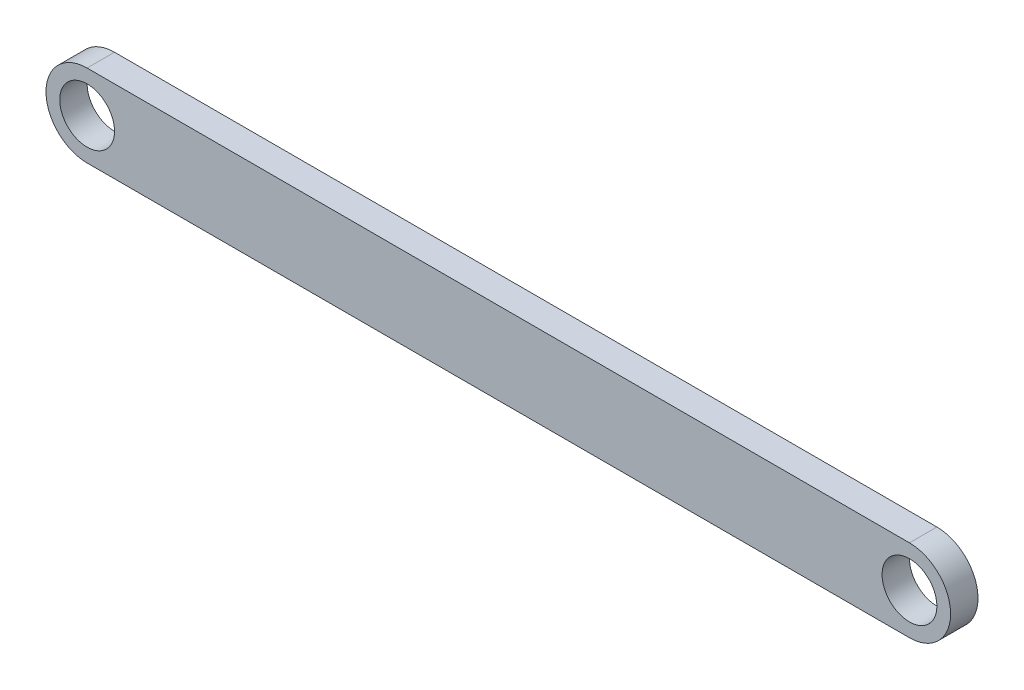
ISO-10303-21;
HEADER;
FILE_DESCRIPTION(('STEP AP214'),'2;1');
FILE_NAME('part.step','',(''),(''),'','','');
FILE_SCHEMA(('AUTOMOTIVE_DESIGN { 1 0 10303 214 1 1 1 1 }'));
ENDSEC;
DATA;
#1=APPLICATION_CONTEXT('core data for automotive mechanical design processes');
#2=APPLICATION_PROTOCOL_DEFINITION('international standard','automotive_design',2000,#1);
#3=PRODUCT_CONTEXT('',#1,'mechanical');
#4=PRODUCT('Part','Part','',(#3));
#5=PRODUCT_RELATED_PRODUCT_CATEGORY('part','',(#4));
#6=PRODUCT_DEFINITION_FORMATION('','',#4);
#7=PRODUCT_DEFINITION_CONTEXT('part definition',#1,'design');
#8=PRODUCT_DEFINITION('design','',#6,#7);
#9=PRODUCT_DEFINITION_SHAPE('','',#8);
#10=(LENGTH_UNIT() NAMED_UNIT(*) SI_UNIT(.MILLI.,.METRE.));
#11=(NAMED_UNIT(*) PLANE_ANGLE_UNIT() SI_UNIT($,.RADIAN.));
#12=(NAMED_UNIT(*) SI_UNIT($,.STERADIAN.) SOLID_ANGLE_UNIT());
#13=UNCERTAINTY_MEASURE_WITH_UNIT(LENGTH_MEASURE(1.E-05),#10,'distance_accuracy_value','');
#14=(GEOMETRIC_REPRESENTATION_CONTEXT(3) GLOBAL_UNCERTAINTY_ASSIGNED_CONTEXT((#13)) GLOBAL_UNIT_ASSIGNED_CONTEXT((#10,
#11,#12)) REPRESENTATION_CONTEXT('',''));
#15=CARTESIAN_POINT('',(0.,0.,0.));
#16=DIRECTION('',(0.,0.,1.));
#17=DIRECTION('',(1.,0.,0.));
#18=AXIS2_PLACEMENT_3D('',#15,#16,#17);
#19=CARTESIAN_POINT('',(-44.7706437358501,0.,2.));
#20=DIRECTION('',(0.,0.,1.));
#21=DIRECTION('',(1.,0.,0.));
#22=AXIS2_PLACEMENT_3D('',#19,#20,#21);
#23=PLANE('',#22);
#24=CARTESIAN_POINT('',(-44.7706437358501,0.,2.));
#25=DIRECTION('',(0.,0.,1.));
#26=DIRECTION('',(1.,0.,0.));
#27=AXIS2_PLACEMENT_3D('',#24,#25,#26);
#28=CIRCLE('',#27,2.);
#29=CARTESIAN_POINT('',(-42.7706437358501,0.,2.));
#30=VERTEX_POINT('',#29);
#31=EDGE_CURVE('E98',#30,#30,#28,.T.);
#32=ORIENTED_EDGE('',*,*,#31,.F.);
#33=EDGE_LOOP('',(#32));
#34=FACE_BOUND('',#33,.T.);
#35=CARTESIAN_POINT('',(-44.7706437358501,0.,2.));
#36=DIRECTION('',(0.,0.,1.));
#37=DIRECTION('',(1.,0.,0.));
#38=AXIS2_PLACEMENT_3D('',#35,#36,#37);
#39=CIRCLE('',#38,3.);
#40=CARTESIAN_POINT('',(-44.7706437358501,3.,2.));
#41=VERTEX_POINT('',#40);
#42=CARTESIAN_POINT('',(-44.7706437358501,-3.,2.));
#43=VERTEX_POINT('',#42);
#44=EDGE_CURVE('E83',#41,#43,#39,.T.);
#45=ORIENTED_EDGE('',*,*,#44,.T.);
#46=DIRECTION('',(1.,0.,0.));
#47=VECTOR('',#46,1.);
#48=CARTESIAN_POINT('',(-44.7706437358501,-3.,2.));
#49=LINE('',#48,#47);
#50=CARTESIAN_POINT('',(15.2293562641499,-3.,2.));
#51=VERTEX_POINT('',#50);
#52=EDGE_CURVE('E78',#43,#51,#49,.T.);
#53=ORIENTED_EDGE('',*,*,#52,.T.);
#54=CARTESIAN_POINT('',(15.2293562641499,0.,2.));
#55=DIRECTION('',(0.,0.,1.));
#56=DIRECTION('',(1.,0.,0.));
#57=AXIS2_PLACEMENT_3D('',#54,#55,#56);
#58=CIRCLE('',#57,3.);
#59=CARTESIAN_POINT('',(15.2293562641499,3.,2.));
#60=VERTEX_POINT('',#59);
#61=EDGE_CURVE('E81',#51,#60,#58,.T.);
#62=ORIENTED_EDGE('',*,*,#61,.T.);
#63=DIRECTION('',(-1.,0.,0.));
#64=VECTOR('',#63,1.);
#65=CARTESIAN_POINT('',(-44.7706437358501,3.,2.));
#66=LINE('',#65,#64);
#67=EDGE_CURVE('E48',#60,#41,#66,.T.);
#68=ORIENTED_EDGE('',*,*,#67,.T.);
#69=EDGE_LOOP('',(#45,#53,#62,#68));
#70=FACE_BOUND('',#69,.T.);
#71=CARTESIAN_POINT('',(15.2293562641499,0.,2.));
#72=DIRECTION('',(0.,0.,1.));
#73=DIRECTION('',(1.,0.,0.));
#74=AXIS2_PLACEMENT_3D('',#71,#72,#73);
#75=CIRCLE('',#74,2.);
#76=CARTESIAN_POINT('',(17.2293562641499,0.,2.));
#77=VERTEX_POINT('',#76);
#78=EDGE_CURVE('E113',#77,#77,#75,.T.);
#79=ORIENTED_EDGE('',*,*,#78,.F.);
#80=EDGE_LOOP('',(#79));
#81=FACE_BOUND('',#80,.T.);
#82=ADVANCED_FACE('F31',(#34,#70,#81),#23,.T.);
#83=CARTESIAN_POINT('',(-44.7706437358501,0.,0.));
#84=DIRECTION('',(0.,0.,1.));
#85=DIRECTION('',(1.,0.,0.));
#86=AXIS2_PLACEMENT_3D('',#83,#84,#85);
#87=PLANE('',#86);
#88=CARTESIAN_POINT('',(-44.7706437358501,0.,0.));
#89=DIRECTION('',(0.,0.,1.));
#90=DIRECTION('',(1.,0.,0.));
#91=AXIS2_PLACEMENT_3D('',#88,#89,#90);
#92=CIRCLE('',#91,2.);
#93=CARTESIAN_POINT('',(-42.7706437358501,0.,0.));
#94=VERTEX_POINT('',#93);
#95=EDGE_CURVE('E110',#94,#94,#92,.T.);
#96=ORIENTED_EDGE('',*,*,#95,.T.);
#97=EDGE_LOOP('',(#96));
#98=FACE_BOUND('',#97,.T.);
#99=CARTESIAN_POINT('',(-44.7706437358501,0.,0.));
#100=DIRECTION('',(0.,0.,1.));
#101=DIRECTION('',(1.,0.,0.));
#102=AXIS2_PLACEMENT_3D('',#99,#100,#101);
#103=CIRCLE('',#102,3.);
#104=CARTESIAN_POINT('',(-44.7706437358501,3.,0.));
#105=VERTEX_POINT('',#104);
#106=CARTESIAN_POINT('',(-44.7706437358501,-3.,0.));
#107=VERTEX_POINT('',#106);
#108=EDGE_CURVE('E95',#105,#107,#103,.T.);
#109=ORIENTED_EDGE('',*,*,#108,.F.);
#110=DIRECTION('',(-1.,0.,0.));
#111=VECTOR('',#110,1.);
#112=CARTESIAN_POINT('',(-44.7706437358501,3.,0.));
#113=LINE('',#112,#111);
#114=CARTESIAN_POINT('',(15.2293562641499,3.,0.));
#115=VERTEX_POINT('',#114);
#116=EDGE_CURVE('E71',#115,#105,#113,.T.);
#117=ORIENTED_EDGE('',*,*,#116,.F.);
#118=CARTESIAN_POINT('',(15.2293562641499,0.,0.));
#119=DIRECTION('',(0.,0.,1.));
#120=DIRECTION('',(1.,0.,0.));
#121=AXIS2_PLACEMENT_3D('',#118,#119,#120);
#122=CIRCLE('',#121,3.);
#123=CARTESIAN_POINT('',(15.2293562641499,-3.,0.));
#124=VERTEX_POINT('',#123);
#125=EDGE_CURVE('E65',#124,#115,#122,.T.);
#126=ORIENTED_EDGE('',*,*,#125,.F.);
#127=DIRECTION('',(1.,0.,0.));
#128=VECTOR('',#127,1.);
#129=CARTESIAN_POINT('',(-44.7706437358501,-3.,0.));
#130=LINE('',#129,#128);
#131=EDGE_CURVE('E87',#107,#124,#130,.T.);
#132=ORIENTED_EDGE('',*,*,#131,.F.);
#133=EDGE_LOOP('',(#109,#117,#126,#132));
#134=FACE_BOUND('',#133,.T.);
#135=CARTESIAN_POINT('',(15.2293562641499,0.,0.));
#136=DIRECTION('',(0.,0.,1.));
#137=DIRECTION('',(1.,0.,0.));
#138=AXIS2_PLACEMENT_3D('',#135,#136,#137);
#139=CIRCLE('',#138,2.);
#140=CARTESIAN_POINT('',(17.2293562641499,0.,0.));
#141=VERTEX_POINT('',#140);
#142=EDGE_CURVE('E116',#141,#141,#139,.T.);
#143=ORIENTED_EDGE('',*,*,#142,.T.);
#144=EDGE_LOOP('',(#143));
#145=FACE_BOUND('',#144,.T.);
#146=ADVANCED_FACE('F106',(#98,#134,#145),#87,.F.);
#147=CARTESIAN_POINT('',(-44.7706437358501,0.,2.));
#148=DIRECTION('',(0.,0.,-1.));
#149=DIRECTION('',(-1.,0.,0.));
#150=AXIS2_PLACEMENT_3D('',#147,#148,#149);
#151=CYLINDRICAL_SURFACE('',#150,3.);
#152=ORIENTED_EDGE('',*,*,#108,.T.);
#153=DIRECTION('',(0.,0.,-1.));
#154=VECTOR('',#153,1.);
#155=CARTESIAN_POINT('',(-44.7706437358501,-3.,2.));
#156=LINE('',#155,#154);
#157=EDGE_CURVE('E11',#43,#107,#156,.T.);
#158=ORIENTED_EDGE('',*,*,#157,.F.);
#159=ORIENTED_EDGE('',*,*,#44,.F.);
#160=DIRECTION('',(0.,0.,-1.));
#161=VECTOR('',#160,1.);
#162=CARTESIAN_POINT('',(-44.7706437358501,3.,2.));
#163=LINE('',#162,#161);
#164=EDGE_CURVE('E91',#41,#105,#163,.T.);
#165=ORIENTED_EDGE('',*,*,#164,.T.);
#166=EDGE_LOOP('',(#152,#158,#159,#165));
#167=FACE_BOUND('',#166,.T.);
#168=ADVANCED_FACE('F33',(#167),#151,.T.);
#169=CARTESIAN_POINT('',(-44.7706437358501,-3.,2.));
#170=DIRECTION('',(0.,1.,0.));
#171=DIRECTION('',(0.,0.,1.));
#172=AXIS2_PLACEMENT_3D('',#169,#170,#171);
#173=PLANE('',#172);
#174=ORIENTED_EDGE('',*,*,#131,.T.);
#175=DIRECTION('',(0.,0.,-1.));
#176=VECTOR('',#175,1.);
#177=CARTESIAN_POINT('',(15.2293562641499,-3.,2.));
#178=LINE('',#177,#176);
#179=EDGE_CURVE('E40',#51,#124,#178,.T.);
#180=ORIENTED_EDGE('',*,*,#179,.F.);
#181=ORIENTED_EDGE('',*,*,#52,.F.);
#182=ORIENTED_EDGE('',*,*,#157,.T.);
#183=EDGE_LOOP('',(#174,#180,#181,#182));
#184=FACE_BOUND('',#183,.T.);
#185=ADVANCED_FACE('F86',(#184),#173,.F.);
#186=CARTESIAN_POINT('',(15.2293562641499,0.,2.));
#187=DIRECTION('',(0.,0.,-1.));
#188=DIRECTION('',(-1.,0.,0.));
#189=AXIS2_PLACEMENT_3D('',#186,#187,#188);
#190=CYLINDRICAL_SURFACE('',#189,3.);
#191=ORIENTED_EDGE('',*,*,#125,.T.);
#192=DIRECTION('',(0.,0.,-1.));
#193=VECTOR('',#192,1.);
#194=CARTESIAN_POINT('',(15.2293562641499,3.,2.));
#195=LINE('',#194,#193);
#196=EDGE_CURVE('E88',#60,#115,#195,.T.);
#197=ORIENTED_EDGE('',*,*,#196,.F.);
#198=ORIENTED_EDGE('',*,*,#61,.F.);
#199=ORIENTED_EDGE('',*,*,#179,.T.);
#200=EDGE_LOOP('',(#191,#197,#198,#199));
#201=FACE_BOUND('',#200,.T.);
#202=ADVANCED_FACE('F89',(#201),#190,.T.);
#203=CARTESIAN_POINT('',(-44.7706437358501,3.,2.));
#204=DIRECTION('',(0.,-1.,0.));
#205=DIRECTION('',(0.,0.,-1.));
#206=AXIS2_PLACEMENT_3D('',#203,#204,#205);
#207=PLANE('',#206);
#208=ORIENTED_EDGE('',*,*,#116,.T.);
#209=ORIENTED_EDGE('',*,*,#164,.F.);
#210=ORIENTED_EDGE('',*,*,#67,.F.);
#211=ORIENTED_EDGE('',*,*,#196,.T.);
#212=EDGE_LOOP('',(#208,#209,#210,#211));
#213=FACE_BOUND('',#212,.T.);
#214=ADVANCED_FACE('F103',(#213),#207,.F.);
#215=CARTESIAN_POINT('',(-44.7706437358501,0.,2.));
#216=DIRECTION('',(0.,0.,-1.));
#217=DIRECTION('',(-1.,0.,0.));
#218=AXIS2_PLACEMENT_3D('',#215,#216,#217);
#219=CYLINDRICAL_SURFACE('',#218,2.);
#220=ORIENTED_EDGE('',*,*,#31,.T.);
#221=EDGE_LOOP('',(#220));
#222=FACE_BOUND('',#221,.T.);
#223=ORIENTED_EDGE('',*,*,#95,.F.);
#224=EDGE_LOOP('',(#223));
#225=FACE_BOUND('',#224,.T.);
#226=ADVANCED_FACE('F134',(#222,#225),#219,.F.);
#227=CARTESIAN_POINT('',(15.2293562641499,0.,2.));
#228=DIRECTION('',(0.,0.,-1.));
#229=DIRECTION('',(-1.,0.,0.));
#230=AXIS2_PLACEMENT_3D('',#227,#228,#229);
#231=CYLINDRICAL_SURFACE('',#230,2.);
#232=ORIENTED_EDGE('',*,*,#78,.T.);
#233=EDGE_LOOP('',(#232));
#234=FACE_BOUND('',#233,.T.);
#235=ORIENTED_EDGE('',*,*,#142,.F.);
#236=EDGE_LOOP('',(#235));
#237=FACE_BOUND('',#236,.T.);
#238=ADVANCED_FACE('F122',(#234,#237),#231,.F.);
#239=CLOSED_SHELL('',(#82,#146,#168,#185,#202,#214,#226,#238));
#240=MANIFOLD_SOLID_BREP('B2',#239);
#241=ADVANCED_BREP_SHAPE_REPRESENTATION('',(#18,#240),#14);
#242=SHAPE_DEFINITION_REPRESENTATION(#9,#241);
ENDSEC;
END-ISO-10303-21;
